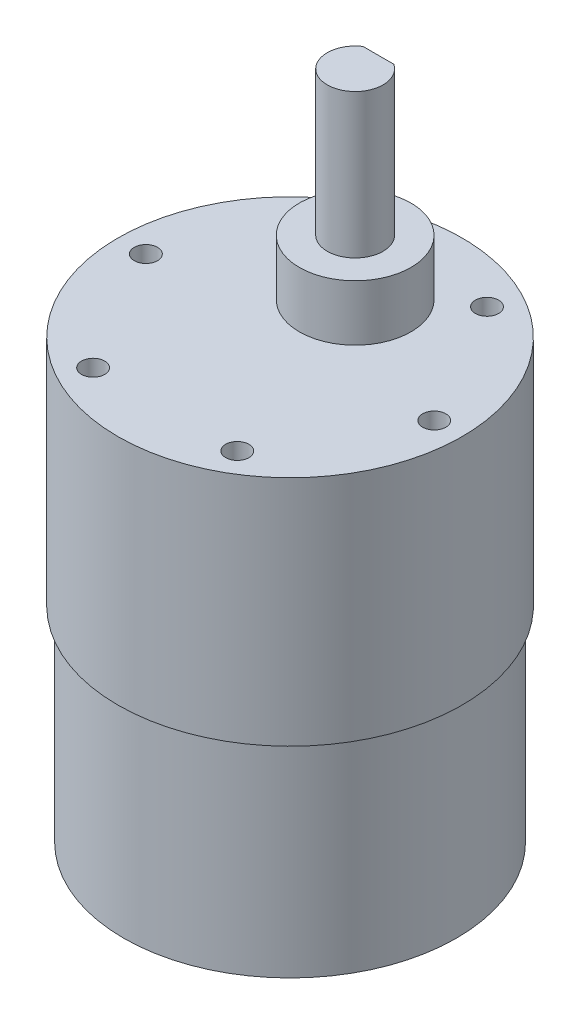
ISO-10303-21;
HEADER;
FILE_DESCRIPTION(('STEP AP214'),'2;1');
FILE_NAME('part.step','',(''),(''),'','','');
FILE_SCHEMA(('AUTOMOTIVE_DESIGN { 1 0 10303 214 1 1 1 1 }'));
ENDSEC;
DATA;
#1=APPLICATION_CONTEXT('core data for automotive mechanical design processes');
#2=APPLICATION_PROTOCOL_DEFINITION('international standard','automotive_design',2000,#1);
#3=PRODUCT_CONTEXT('',#1,'mechanical');
#4=PRODUCT('Part','Part','',(#3));
#5=PRODUCT_RELATED_PRODUCT_CATEGORY('part','',(#4));
#6=PRODUCT_DEFINITION_FORMATION('','',#4);
#7=PRODUCT_DEFINITION_CONTEXT('part definition',#1,'design');
#8=PRODUCT_DEFINITION('design','',#6,#7);
#9=PRODUCT_DEFINITION_SHAPE('','',#8);
#10=(LENGTH_UNIT() NAMED_UNIT(*) SI_UNIT(.MILLI.,.METRE.));
#11=(NAMED_UNIT(*) PLANE_ANGLE_UNIT() SI_UNIT($,.RADIAN.));
#12=(NAMED_UNIT(*) SI_UNIT($,.STERADIAN.) SOLID_ANGLE_UNIT());
#13=UNCERTAINTY_MEASURE_WITH_UNIT(LENGTH_MEASURE(1.E-05),#10,'distance_accuracy_value','');
#14=(GEOMETRIC_REPRESENTATION_CONTEXT(3) GLOBAL_UNCERTAINTY_ASSIGNED_CONTEXT((#13)) GLOBAL_UNIT_ASSIGNED_CONTEXT((#10,
#11,#12)) REPRESENTATION_CONTEXT('',''));
#15=CARTESIAN_POINT('',(0.,0.,0.));
#16=DIRECTION('',(0.,0.,1.));
#17=DIRECTION('',(1.,0.,0.));
#18=AXIS2_PLACEMENT_3D('',#15,#16,#17);
#19=CARTESIAN_POINT('',(0.,30.999999976,-6.99999997));
#20=DIRECTION('',(0.,1.,0.));
#21=DIRECTION('',(0.,0.,1.));
#22=AXIS2_PLACEMENT_3D('',#19,#20,#21);
#23=PLANE('',#22);
#24=CARTESIAN_POINT('',(0.,30.999999976,-6.99999997));
#25=DIRECTION('',(0.,1.,0.));
#26=DIRECTION('',(0.,0.,1.));
#27=AXIS2_PLACEMENT_3D('',#24,#25,#26);
#28=CIRCLE('',#27,5.999999938);
#29=CARTESIAN_POINT('',(0.,30.999999976,-1.000000032));
#30=VERTEX_POINT('',#29);
#31=EDGE_CURVE('E146',#30,#30,#28,.T.);
#32=ORIENTED_EDGE('',*,*,#31,.T.);
#33=EDGE_LOOP('',(#32));
#34=FACE_BOUND('',#33,.T.);
#35=CARTESIAN_POINT('',(0.,30.999999976,-6.99999997));
#36=DIRECTION('',(0.,1.,0.));
#37=DIRECTION('',(0.,0.,1.));
#38=AXIS2_PLACEMENT_3D('',#35,#36,#37);
#39=CIRCLE('',#38,2.999999969);
#40=CARTESIAN_POINT('',(0.,30.999999976,-4.000000001));
#41=VERTEX_POINT('',#40);
#42=EDGE_CURVE('E136',#41,#41,#39,.T.);
#43=ORIENTED_EDGE('',*,*,#42,.F.);
#44=EDGE_LOOP('',(#43));
#45=FACE_BOUND('',#44,.T.);
#46=ADVANCED_FACE('F36',(#34,#45),#23,.T.);
#47=CARTESIAN_POINT('',(0.,25.000000038,0.));
#48=DIRECTION('',(0.,-1.,0.));
#49=DIRECTION('',(0.,0.,-1.));
#50=AXIS2_PLACEMENT_3D('',#47,#48,#49);
#51=CYLINDRICAL_SURFACE('',#50,18.499999957);
#52=CARTESIAN_POINT('',(0.,25.000000038,0.));
#53=DIRECTION('',(0.,1.,0.));
#54=DIRECTION('',(0.,0.,1.));
#55=AXIS2_PLACEMENT_3D('',#52,#53,#54);
#56=CIRCLE('',#55,18.499999957);
#57=CARTESIAN_POINT('',(0.,25.000000038,18.499999957));
#58=VERTEX_POINT('',#57);
#59=EDGE_CURVE('E150',#58,#58,#56,.T.);
#60=ORIENTED_EDGE('',*,*,#59,.F.);
#61=EDGE_LOOP('',(#60));
#62=FACE_BOUND('',#61,.T.);
#63=CARTESIAN_POINT('',(0.,0.,0.));
#64=DIRECTION('',(0.,1.,0.));
#65=DIRECTION('',(0.,0.,1.));
#66=AXIS2_PLACEMENT_3D('',#63,#64,#65);
#67=CIRCLE('',#66,18.499999957);
#68=CARTESIAN_POINT('',(0.,0.,18.499999957));
#69=VERTEX_POINT('',#68);
#70=EDGE_CURVE('E40',#69,#69,#67,.T.);
#71=ORIENTED_EDGE('',*,*,#70,.T.);
#72=EDGE_LOOP('',(#71));
#73=FACE_BOUND('',#72,.T.);
#74=ADVANCED_FACE('F38',(#62,#73),#51,.T.);
#75=CARTESIAN_POINT('',(0.,25.000000038,0.));
#76=DIRECTION('',(0.,1.,0.));
#77=DIRECTION('',(0.,0.,1.));
#78=AXIS2_PLACEMENT_3D('',#75,#76,#77);
#79=PLANE('',#78);
#80=CARTESIAN_POINT('',(-15.499999988,25.000000038,0.));
#81=DIRECTION('',(0.,1.,0.));
#82=DIRECTION('',(0.,0.,1.));
#83=AXIS2_PLACEMENT_3D('',#80,#81,#82);
#84=CIRCLE('',#83,1.24999999999999);
#85=CARTESIAN_POINT('',(-15.499999988,25.000000038,1.24999999999999));
#86=VERTEX_POINT('',#85);
#87=EDGE_CURVE('E96',#86,#86,#84,.T.);
#88=ORIENTED_EDGE('',*,*,#87,.F.);
#89=EDGE_LOOP('',(#88));
#90=FACE_BOUND('',#89,.T.);
#91=CARTESIAN_POINT('',(-7.74999999399997,25.000000038,-13.4233937482665));
#92=DIRECTION('',(0.,1.,0.));
#93=DIRECTION('',(0.,0.,1.));
#94=AXIS2_PLACEMENT_3D('',#91,#92,#93);
#95=CIRCLE('',#94,1.24999999999999);
#96=CARTESIAN_POINT('',(-7.74999999399997,25.000000038,-12.1733937482665));
#97=VERTEX_POINT('',#96);
#98=EDGE_CURVE('E95',#97,#97,#95,.T.);
#99=ORIENTED_EDGE('',*,*,#98,.F.);
#100=EDGE_LOOP('',(#99));
#101=FACE_BOUND('',#100,.T.);
#102=CARTESIAN_POINT('',(7.74999999400006,25.000000038,-13.4233937482665));
#103=DIRECTION('',(0.,1.,0.));
#104=DIRECTION('',(0.,0.,1.));
#105=AXIS2_PLACEMENT_3D('',#102,#103,#104);
#106=CIRCLE('',#105,1.24999999999999);
#107=CARTESIAN_POINT('',(7.74999999400006,25.000000038,-12.1733937482665));
#108=VERTEX_POINT('',#107);
#109=EDGE_CURVE('E107',#108,#108,#106,.T.);
#110=ORIENTED_EDGE('',*,*,#109,.F.);
#111=EDGE_LOOP('',(#110));
#112=FACE_BOUND('',#111,.T.);
#113=CARTESIAN_POINT('',(15.499999988,25.000000038,1.08235921420342E-13));
#114=DIRECTION('',(0.,1.,0.));
#115=DIRECTION('',(0.,0.,1.));
#116=AXIS2_PLACEMENT_3D('',#113,#114,#115);
#117=CIRCLE('',#116,1.24999999999999);
#118=CARTESIAN_POINT('',(15.499999988,25.000000038,1.2500000000001));
#119=VERTEX_POINT('',#118);
#120=EDGE_CURVE('E113',#119,#119,#117,.T.);
#121=ORIENTED_EDGE('',*,*,#120,.F.);
#122=EDGE_LOOP('',(#121));
#123=FACE_BOUND('',#122,.T.);
#124=CARTESIAN_POINT('',(7.74999999399988,25.000000038,13.4233937482666));
#125=DIRECTION('',(0.,1.,0.));
#126=DIRECTION('',(0.,0.,1.));
#127=AXIS2_PLACEMENT_3D('',#124,#125,#126);
#128=CIRCLE('',#127,1.24999999999999);
#129=CARTESIAN_POINT('',(7.74999999399988,25.000000038,14.6733937482666));
#130=VERTEX_POINT('',#129);
#131=EDGE_CURVE('E119',#130,#130,#128,.T.);
#132=ORIENTED_EDGE('',*,*,#131,.F.);
#133=EDGE_LOOP('',(#132));
#134=FACE_BOUND('',#133,.T.);
#135=CARTESIAN_POINT('',(-7.74999999400016,25.000000038,13.4233937482664));
#136=DIRECTION('',(0.,1.,0.));
#137=DIRECTION('',(0.,0.,1.));
#138=AXIS2_PLACEMENT_3D('',#135,#136,#137);
#139=CIRCLE('',#138,1.24999999999999);
#140=CARTESIAN_POINT('',(-7.74999999400016,25.000000038,14.6733937482664));
#141=VERTEX_POINT('',#140);
#142=EDGE_CURVE('E125',#141,#141,#139,.T.);
#143=ORIENTED_EDGE('',*,*,#142,.F.);
#144=EDGE_LOOP('',(#143));
#145=FACE_BOUND('',#144,.T.);
#146=CARTESIAN_POINT('',(0.,25.000000038,-6.99999997));
#147=DIRECTION('',(0.,1.,0.));
#148=DIRECTION('',(0.,0.,1.));
#149=AXIS2_PLACEMENT_3D('',#146,#147,#148);
#150=CIRCLE('',#149,5.999999938);
#151=CARTESIAN_POINT('',(0.,25.000000038,-1.000000032));
#152=VERTEX_POINT('',#151);
#153=EDGE_CURVE('E45',#152,#152,#150,.T.);
#154=ORIENTED_EDGE('',*,*,#153,.F.);
#155=EDGE_LOOP('',(#154));
#156=FACE_BOUND('',#155,.T.);
#157=ORIENTED_EDGE('',*,*,#59,.T.);
#158=EDGE_LOOP('',(#157));
#159=FACE_BOUND('',#158,.T.);
#160=ADVANCED_FACE('F161',(#90,#101,#112,#123,#134,#145,#156,#159),#79,.T.);
#161=CARTESIAN_POINT('',(0.,0.,0.));
#162=DIRECTION('',(0.,1.,0.));
#163=DIRECTION('',(0.,0.,1.));
#164=AXIS2_PLACEMENT_3D('',#161,#162,#163);
#165=PLANE('',#164);
#166=CARTESIAN_POINT('',(0.,0.,0.));
#167=DIRECTION('',(0.,-1.,0.));
#168=DIRECTION('',(0.,0.,-1.));
#169=AXIS2_PLACEMENT_3D('',#166,#167,#168);
#170=CIRCLE('',#169,17.900000014);
#171=CARTESIAN_POINT('',(0.,0.,-17.900000014));
#172=VERTEX_POINT('',#171);
#173=EDGE_CURVE('E11',#172,#172,#170,.T.);
#174=ORIENTED_EDGE('',*,*,#173,.F.);
#175=EDGE_LOOP('',(#174));
#176=FACE_BOUND('',#175,.T.);
#177=ORIENTED_EDGE('',*,*,#70,.F.);
#178=EDGE_LOOP('',(#177));
#179=FACE_BOUND('',#178,.T.);
#180=ADVANCED_FACE('F158',(#176,#179),#165,.F.);
#181=CARTESIAN_POINT('',(0.,30.999999976,-6.99999997));
#182=DIRECTION('',(0.,-1.,0.));
#183=DIRECTION('',(0.,0.,-1.));
#184=AXIS2_PLACEMENT_3D('',#181,#182,#183);
#185=CYLINDRICAL_SURFACE('',#184,5.999999938);
#186=ORIENTED_EDGE('',*,*,#31,.F.);
#187=EDGE_LOOP('',(#186));
#188=FACE_BOUND('',#187,.T.);
#189=ORIENTED_EDGE('',*,*,#153,.T.);
#190=EDGE_LOOP('',(#189));
#191=FACE_BOUND('',#190,.T.);
#192=ADVANCED_FACE('F160',(#188,#191),#185,.T.);
#193=CARTESIAN_POINT('',(0.,46.499999964,-9.50000005));
#194=DIRECTION('',(0.,0.,-1.));
#195=DIRECTION('',(-1.,0.,0.));
#196=AXIS2_PLACEMENT_3D('',#193,#194,#195);
#197=PLANE('',#196);
#198=DIRECTION('',(1.,0.,0.));
#199=VECTOR('',#198,1.);
#200=CARTESIAN_POINT('',(0.,36.999999914,-9.50000005));
#201=LINE('',#200,#199);
#202=CARTESIAN_POINT('',(-1.65831221849204,36.999999914,-9.50000005));
#203=VERTEX_POINT('',#202);
#204=CARTESIAN_POINT('',(1.65831221849204,36.999999914,-9.50000005));
#205=VERTEX_POINT('',#204);
#206=EDGE_CURVE('E131',#203,#205,#201,.T.);
#207=ORIENTED_EDGE('',*,*,#206,.F.);
#208=DIRECTION('',(0.,-1.,0.));
#209=VECTOR('',#208,1.);
#210=CARTESIAN_POINT('',(-1.65831221849204,46.499999964,-9.50000005));
#211=LINE('',#210,#209);
#212=CARTESIAN_POINT('',(-1.65831221849204,46.499999964,-9.50000005));
#213=VERTEX_POINT('',#212);
#214=EDGE_CURVE('E60',#213,#203,#211,.T.);
#215=ORIENTED_EDGE('',*,*,#214,.F.);
#216=DIRECTION('',(1.,0.,0.));
#217=VECTOR('',#216,1.);
#218=CARTESIAN_POINT('',(0.,46.499999964,-9.50000005));
#219=LINE('',#218,#217);
#220=CARTESIAN_POINT('',(1.65831221849204,46.499999964,-9.50000005));
#221=VERTEX_POINT('',#220);
#222=EDGE_CURVE('E137',#213,#221,#219,.T.);
#223=ORIENTED_EDGE('',*,*,#222,.T.);
#224=DIRECTION('',(0.,-1.,0.));
#225=VECTOR('',#224,1.);
#226=CARTESIAN_POINT('',(1.65831221849204,46.499999964,-9.50000005));
#227=LINE('',#226,#225);
#228=EDGE_CURVE('E140',#221,#205,#227,.T.);
#229=ORIENTED_EDGE('',*,*,#228,.T.);
#230=EDGE_LOOP('',(#207,#215,#223,#229));
#231=FACE_BOUND('',#230,.T.);
#232=ADVANCED_FACE('F167',(#231),#197,.T.);
#233=CARTESIAN_POINT('',(0.,46.499999964,-6.99999997));
#234=DIRECTION('',(0.,-1.,0.));
#235=DIRECTION('',(0.,0.,-1.));
#236=AXIS2_PLACEMENT_3D('',#233,#234,#235);
#237=CYLINDRICAL_SURFACE('',#236,2.999999969);
#238=ORIENTED_EDGE('',*,*,#42,.T.);
#239=EDGE_LOOP('',(#238));
#240=FACE_BOUND('',#239,.T.);
#241=CARTESIAN_POINT('',(0.,36.999999914,-6.99999997));
#242=DIRECTION('',(0.,1.,0.));
#243=DIRECTION('',(0.,0.,1.));
#244=AXIS2_PLACEMENT_3D('',#241,#242,#243);
#245=CIRCLE('',#244,2.999999969);
#246=EDGE_CURVE('E134',#205,#203,#245,.T.);
#247=ORIENTED_EDGE('',*,*,#246,.F.);
#248=ORIENTED_EDGE('',*,*,#228,.F.);
#249=CARTESIAN_POINT('',(0.,46.499999964,-6.99999997));
#250=DIRECTION('',(0.,1.,0.));
#251=DIRECTION('',(0.,0.,1.));
#252=AXIS2_PLACEMENT_3D('',#249,#250,#251);
#253=CIRCLE('',#252,2.999999969);
#254=EDGE_CURVE('E52',#213,#221,#253,.T.);
#255=ORIENTED_EDGE('',*,*,#254,.F.);
#256=ORIENTED_EDGE('',*,*,#214,.T.);
#257=EDGE_LOOP('',(#247,#248,#255,#256));
#258=FACE_BOUND('',#257,.T.);
#259=ADVANCED_FACE('F184',(#240,#258),#237,.T.);
#260=CARTESIAN_POINT('',(0.,46.499999964,0.));
#261=DIRECTION('',(0.,1.,0.));
#262=DIRECTION('',(0.,0.,1.));
#263=AXIS2_PLACEMENT_3D('',#260,#261,#262);
#264=PLANE('',#263);
#265=ORIENTED_EDGE('',*,*,#222,.F.);
#266=ORIENTED_EDGE('',*,*,#254,.T.);
#267=EDGE_LOOP('',(#265,#266));
#268=FACE_BOUND('',#267,.T.);
#269=ADVANCED_FACE('F187',(#268),#264,.T.);
#270=CARTESIAN_POINT('',(0.,36.999999914,0.));
#271=DIRECTION('',(0.,1.,0.));
#272=DIRECTION('',(0.,0.,1.));
#273=AXIS2_PLACEMENT_3D('',#270,#271,#272);
#274=PLANE('',#273);
#275=ORIENTED_EDGE('',*,*,#206,.T.);
#276=ORIENTED_EDGE('',*,*,#246,.T.);
#277=EDGE_LOOP('',(#275,#276));
#278=FACE_BOUND('',#277,.T.);
#279=ADVANCED_FACE('F191',(#278),#274,.T.);
#280=CARTESIAN_POINT('',(-7.74999999400016,21.500007038,13.4233937482664));
#281=DIRECTION('',(0.,1.,0.));
#282=DIRECTION('',(0.,0.,1.));
#283=AXIS2_PLACEMENT_3D('',#280,#281,#282);
#284=CONICAL_SURFACE('',#283,1.25,1.02974425867665);
#285=CARTESIAN_POINT('',(-7.74999999400016,20.7489312642155,13.4233937482664));
#286=VERTEX_POINT('',#285);
#287=VERTEX_LOOP('',#286);
#288=FACE_BOUND('',#287,.T.);
#289=CARTESIAN_POINT('',(-7.74999999400016,21.500007038,13.4233937482664));
#290=DIRECTION('',(0.,1.,0.));
#291=DIRECTION('',(0.,0.,1.));
#292=AXIS2_PLACEMENT_3D('',#289,#290,#291);
#293=CIRCLE('',#292,1.25);
#294=CARTESIAN_POINT('',(-7.74999999400016,21.500007038,14.6733937482664));
#295=VERTEX_POINT('',#294);
#296=EDGE_CURVE('E128',#295,#295,#293,.T.);
#297=ORIENTED_EDGE('',*,*,#296,.T.);
#298=EDGE_LOOP('',(#297));
#299=FACE_BOUND('',#298,.T.);
#300=ADVANCED_FACE('F194',(#288,#299),#284,.F.);
#301=CARTESIAN_POINT('',(-7.74999999400016,25.000000038,13.4233937482664));
#302=DIRECTION('',(0.,1.,0.));
#303=DIRECTION('',(0.,0.,1.));
#304=AXIS2_PLACEMENT_3D('',#301,#302,#303);
#305=CYLINDRICAL_SURFACE('',#304,1.24999999999999);
#306=ORIENTED_EDGE('',*,*,#296,.F.);
#307=EDGE_LOOP('',(#306));
#308=FACE_BOUND('',#307,.T.);
#309=ORIENTED_EDGE('',*,*,#142,.T.);
#310=EDGE_LOOP('',(#309));
#311=FACE_BOUND('',#310,.T.);
#312=ADVANCED_FACE('F198',(#308,#311),#305,.F.);
#313=CARTESIAN_POINT('',(7.74999999399988,21.500007038,13.4233937482666));
#314=DIRECTION('',(0.,1.,0.));
#315=DIRECTION('',(0.,0.,1.));
#316=AXIS2_PLACEMENT_3D('',#313,#314,#315);
#317=CONICAL_SURFACE('',#316,1.25,1.02974425867665);
#318=CARTESIAN_POINT('',(7.74999999399988,20.7489312642155,13.4233937482666));
#319=VERTEX_POINT('',#318);
#320=VERTEX_LOOP('',#319);
#321=FACE_BOUND('',#320,.T.);
#322=CARTESIAN_POINT('',(7.74999999399988,21.500007038,13.4233937482666));
#323=DIRECTION('',(0.,1.,0.));
#324=DIRECTION('',(0.,0.,1.));
#325=AXIS2_PLACEMENT_3D('',#322,#323,#324);
#326=CIRCLE('',#325,1.25);
#327=CARTESIAN_POINT('',(7.74999999399988,21.500007038,14.6733937482666));
#328=VERTEX_POINT('',#327);
#329=EDGE_CURVE('E122',#328,#328,#326,.T.);
#330=ORIENTED_EDGE('',*,*,#329,.T.);
#331=EDGE_LOOP('',(#330));
#332=FACE_BOUND('',#331,.T.);
#333=ADVANCED_FACE('F202',(#321,#332),#317,.F.);
#334=CARTESIAN_POINT('',(7.74999999399988,25.000000038,13.4233937482666));
#335=DIRECTION('',(0.,1.,0.));
#336=DIRECTION('',(0.,0.,1.));
#337=AXIS2_PLACEMENT_3D('',#334,#335,#336);
#338=CYLINDRICAL_SURFACE('',#337,1.24999999999999);
#339=ORIENTED_EDGE('',*,*,#329,.F.);
#340=EDGE_LOOP('',(#339));
#341=FACE_BOUND('',#340,.T.);
#342=ORIENTED_EDGE('',*,*,#131,.T.);
#343=EDGE_LOOP('',(#342));
#344=FACE_BOUND('',#343,.T.);
#345=ADVANCED_FACE('F206',(#341,#344),#338,.F.);
#346=CARTESIAN_POINT('',(15.499999988,21.500007038,1.08235921420342E-13));
#347=DIRECTION('',(0.,1.,0.));
#348=DIRECTION('',(0.,0.,1.));
#349=AXIS2_PLACEMENT_3D('',#346,#347,#348);
#350=CONICAL_SURFACE('',#349,1.25,1.02974425867665);
#351=CARTESIAN_POINT('',(15.499999988,20.7489312642155,1.08235921420342E-13));
#352=VERTEX_POINT('',#351);
#353=VERTEX_LOOP('',#352);
#354=FACE_BOUND('',#353,.T.);
#355=CARTESIAN_POINT('',(15.499999988,21.500007038,1.08235921420342E-13));
#356=DIRECTION('',(0.,1.,0.));
#357=DIRECTION('',(0.,0.,1.));
#358=AXIS2_PLACEMENT_3D('',#355,#356,#357);
#359=CIRCLE('',#358,1.25);
#360=CARTESIAN_POINT('',(15.499999988,21.500007038,1.25000000000011));
#361=VERTEX_POINT('',#360);
#362=EDGE_CURVE('E116',#361,#361,#359,.T.);
#363=ORIENTED_EDGE('',*,*,#362,.T.);
#364=EDGE_LOOP('',(#363));
#365=FACE_BOUND('',#364,.T.);
#366=ADVANCED_FACE('F210',(#354,#365),#350,.F.);
#367=CARTESIAN_POINT('',(15.499999988,25.000000038,1.08235921420342E-13));
#368=DIRECTION('',(0.,1.,0.));
#369=DIRECTION('',(0.,0.,1.));
#370=AXIS2_PLACEMENT_3D('',#367,#368,#369);
#371=CYLINDRICAL_SURFACE('',#370,1.24999999999999);
#372=ORIENTED_EDGE('',*,*,#362,.F.);
#373=EDGE_LOOP('',(#372));
#374=FACE_BOUND('',#373,.T.);
#375=ORIENTED_EDGE('',*,*,#120,.T.);
#376=EDGE_LOOP('',(#375));
#377=FACE_BOUND('',#376,.T.);
#378=ADVANCED_FACE('F214',(#374,#377),#371,.F.);
#379=CARTESIAN_POINT('',(7.74999999400006,21.500007038,-13.4233937482665));
#380=DIRECTION('',(0.,1.,0.));
#381=DIRECTION('',(0.,0.,1.));
#382=AXIS2_PLACEMENT_3D('',#379,#380,#381);
#383=CONICAL_SURFACE('',#382,1.25,1.02974425867665);
#384=CARTESIAN_POINT('',(7.74999999400006,20.7489312642155,-13.4233937482665));
#385=VERTEX_POINT('',#384);
#386=VERTEX_LOOP('',#385);
#387=FACE_BOUND('',#386,.T.);
#388=CARTESIAN_POINT('',(7.74999999400006,21.500007038,-13.4233937482665));
#389=DIRECTION('',(0.,1.,0.));
#390=DIRECTION('',(0.,0.,1.));
#391=AXIS2_PLACEMENT_3D('',#388,#389,#390);
#392=CIRCLE('',#391,1.25);
#393=CARTESIAN_POINT('',(7.74999999400006,21.500007038,-12.1733937482665));
#394=VERTEX_POINT('',#393);
#395=EDGE_CURVE('E110',#394,#394,#392,.T.);
#396=ORIENTED_EDGE('',*,*,#395,.T.);
#397=EDGE_LOOP('',(#396));
#398=FACE_BOUND('',#397,.T.);
#399=ADVANCED_FACE('F218',(#387,#398),#383,.F.);
#400=CARTESIAN_POINT('',(7.74999999400006,25.000000038,-13.4233937482665));
#401=DIRECTION('',(0.,1.,0.));
#402=DIRECTION('',(0.,0.,1.));
#403=AXIS2_PLACEMENT_3D('',#400,#401,#402);
#404=CYLINDRICAL_SURFACE('',#403,1.24999999999999);
#405=ORIENTED_EDGE('',*,*,#395,.F.);
#406=EDGE_LOOP('',(#405));
#407=FACE_BOUND('',#406,.T.);
#408=ORIENTED_EDGE('',*,*,#109,.T.);
#409=EDGE_LOOP('',(#408));
#410=FACE_BOUND('',#409,.T.);
#411=ADVANCED_FACE('F222',(#407,#410),#404,.F.);
#412=CARTESIAN_POINT('',(-7.74999999399997,21.500007038,-13.4233937482665));
#413=DIRECTION('',(0.,1.,0.));
#414=DIRECTION('',(0.,0.,1.));
#415=AXIS2_PLACEMENT_3D('',#412,#413,#414);
#416=CONICAL_SURFACE('',#415,1.25,1.02974425867665);
#417=CARTESIAN_POINT('',(-7.74999999399997,20.7489312642155,-13.4233937482665));
#418=VERTEX_POINT('',#417);
#419=VERTEX_LOOP('',#418);
#420=FACE_BOUND('',#419,.T.);
#421=CARTESIAN_POINT('',(-7.74999999399997,21.500007038,-13.4233937482665));
#422=DIRECTION('',(0.,1.,0.));
#423=DIRECTION('',(0.,0.,1.));
#424=AXIS2_PLACEMENT_3D('',#421,#422,#423);
#425=CIRCLE('',#424,1.25);
#426=CARTESIAN_POINT('',(-7.74999999399997,21.500007038,-12.1733937482665));
#427=VERTEX_POINT('',#426);
#428=EDGE_CURVE('E99',#427,#427,#425,.T.);
#429=ORIENTED_EDGE('',*,*,#428,.T.);
#430=EDGE_LOOP('',(#429));
#431=FACE_BOUND('',#430,.T.);
#432=ADVANCED_FACE('F226',(#420,#431),#416,.F.);
#433=CARTESIAN_POINT('',(-7.74999999399997,25.000000038,-13.4233937482665));
#434=DIRECTION('',(0.,1.,0.));
#435=DIRECTION('',(0.,0.,1.));
#436=AXIS2_PLACEMENT_3D('',#433,#434,#435);
#437=CYLINDRICAL_SURFACE('',#436,1.24999999999999);
#438=ORIENTED_EDGE('',*,*,#428,.F.);
#439=EDGE_LOOP('',(#438));
#440=FACE_BOUND('',#439,.T.);
#441=ORIENTED_EDGE('',*,*,#98,.T.);
#442=EDGE_LOOP('',(#441));
#443=FACE_BOUND('',#442,.T.);
#444=ADVANCED_FACE('F89',(#440,#443),#437,.F.);
#445=CARTESIAN_POINT('',(-15.499999988,21.500007038,0.));
#446=DIRECTION('',(0.,1.,0.));
#447=DIRECTION('',(0.,0.,1.));
#448=AXIS2_PLACEMENT_3D('',#445,#446,#447);
#449=CONICAL_SURFACE('',#448,1.25,1.02974425867665);
#450=CARTESIAN_POINT('',(-15.499999988,20.7489312642155,0.));
#451=VERTEX_POINT('',#450);
#452=VERTEX_LOOP('',#451);
#453=FACE_BOUND('',#452,.T.);
#454=CARTESIAN_POINT('',(-15.499999988,21.500007038,0.));
#455=DIRECTION('',(0.,1.,0.));
#456=DIRECTION('',(0.,0.,1.));
#457=AXIS2_PLACEMENT_3D('',#454,#455,#456);
#458=CIRCLE('',#457,1.25);
#459=CARTESIAN_POINT('',(-15.499999988,21.500007038,1.25));
#460=VERTEX_POINT('',#459);
#461=EDGE_CURVE('E93',#460,#460,#458,.T.);
#462=ORIENTED_EDGE('',*,*,#461,.T.);
#463=EDGE_LOOP('',(#462));
#464=FACE_BOUND('',#463,.T.);
#465=ADVANCED_FACE('F85',(#453,#464),#449,.F.);
#466=CARTESIAN_POINT('',(-15.499999988,25.000000038,0.));
#467=DIRECTION('',(0.,1.,0.));
#468=DIRECTION('',(0.,0.,1.));
#469=AXIS2_PLACEMENT_3D('',#466,#467,#468);
#470=CYLINDRICAL_SURFACE('',#469,1.24999999999999);
#471=ORIENTED_EDGE('',*,*,#461,.F.);
#472=EDGE_LOOP('',(#471));
#473=FACE_BOUND('',#472,.T.);
#474=ORIENTED_EDGE('',*,*,#87,.T.);
#475=EDGE_LOOP('',(#474));
#476=FACE_BOUND('',#475,.T.);
#477=ADVANCED_FACE('F88',(#473,#476),#470,.F.);
#478=CARTESIAN_POINT('',(0.,-21.999999942,0.));
#479=DIRECTION('',(0.,1.,0.));
#480=DIRECTION('',(0.,0.,1.));
#481=AXIS2_PLACEMENT_3D('',#478,#479,#480);
#482=CYLINDRICAL_SURFACE('',#481,17.900000014);
#483=CARTESIAN_POINT('',(0.,-21.999999942,0.));
#484=DIRECTION('',(0.,-1.,0.));
#485=DIRECTION('',(0.,0.,-1.));
#486=AXIS2_PLACEMENT_3D('',#483,#484,#485);
#487=CIRCLE('',#486,17.900000014);
#488=CARTESIAN_POINT('',(0.,-21.999999942,-17.900000014));
#489=VERTEX_POINT('',#488);
#490=EDGE_CURVE('E102',#489,#489,#487,.T.);
#491=ORIENTED_EDGE('',*,*,#490,.F.);
#492=EDGE_LOOP('',(#491));
#493=FACE_BOUND('',#492,.T.);
#494=ORIENTED_EDGE('',*,*,#173,.T.);
#495=EDGE_LOOP('',(#494));
#496=FACE_BOUND('',#495,.T.);
#497=ADVANCED_FACE('F236',(#493,#496),#482,.T.);
#498=CARTESIAN_POINT('',(0.,-21.999999942,0.));
#499=DIRECTION('',(0.,-1.,0.));
#500=DIRECTION('',(0.,0.,-1.));
#501=AXIS2_PLACEMENT_3D('',#498,#499,#500);
#502=PLANE('',#501);
#503=ORIENTED_EDGE('',*,*,#490,.T.);
#504=EDGE_LOOP('',(#503));
#505=FACE_BOUND('',#504,.T.);
#506=ADVANCED_FACE('F239',(#505),#502,.T.);
#507=CLOSED_SHELL('',(#46,#74,#160,#180,#192,#232,#259,#269,#279,#300,#312,#333,#345,#366,#378,
#399,#411,#432,#444,#465,#477,#497,#506));
#508=MANIFOLD_SOLID_BREP('B2',#507);
#509=ADVANCED_BREP_SHAPE_REPRESENTATION('',(#18,#508),#14);
#510=SHAPE_DEFINITION_REPRESENTATION(#9,#509);
ENDSEC;
END-ISO-10303-21;
